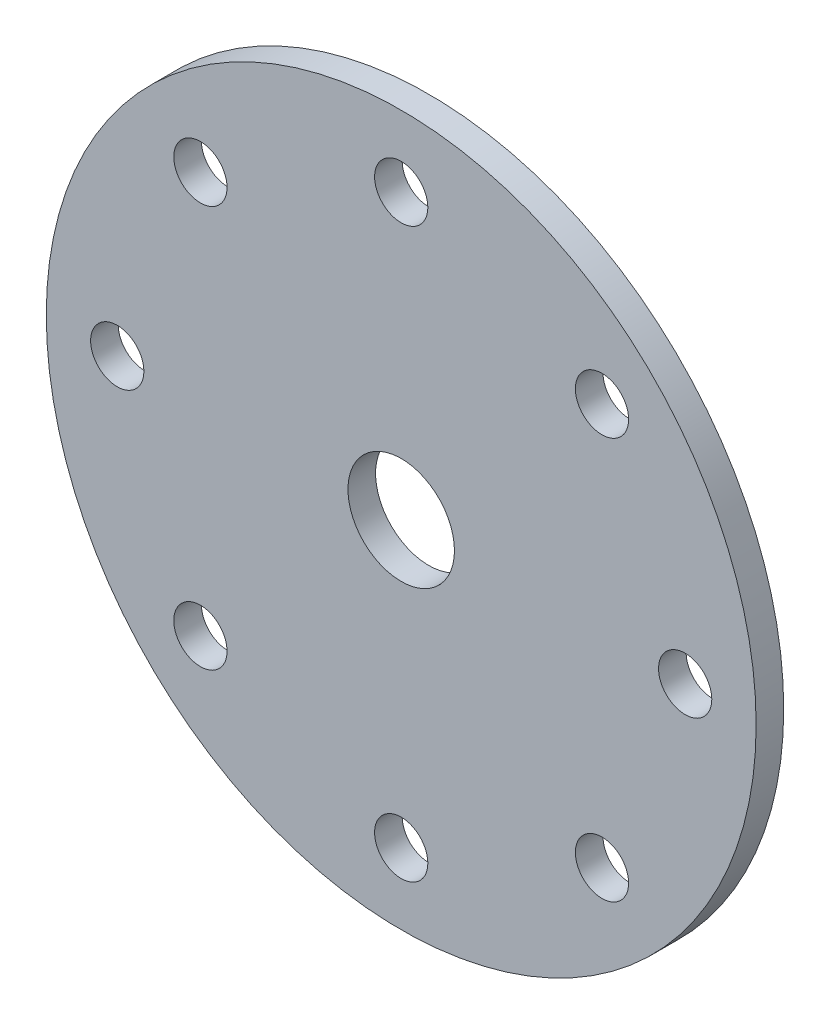
ISO-10303-21;
HEADER;
FILE_DESCRIPTION(('STEP AP214'),'2;1');
FILE_NAME('part.step','',(''),(''),'','','');
FILE_SCHEMA(('AUTOMOTIVE_DESIGN { 1 0 10303 214 1 1 1 1 }'));
ENDSEC;
DATA;
#1=APPLICATION_CONTEXT('core data for automotive mechanical design processes');
#2=APPLICATION_PROTOCOL_DEFINITION('international standard','automotive_design',2000,#1);
#3=PRODUCT_CONTEXT('',#1,'mechanical');
#4=PRODUCT('Part','Part','',(#3));
#5=PRODUCT_RELATED_PRODUCT_CATEGORY('part','',(#4));
#6=PRODUCT_DEFINITION_FORMATION('','',#4);
#7=PRODUCT_DEFINITION_CONTEXT('part definition',#1,'design');
#8=PRODUCT_DEFINITION('design','',#6,#7);
#9=PRODUCT_DEFINITION_SHAPE('','',#8);
#10=(LENGTH_UNIT() NAMED_UNIT(*) SI_UNIT(.MILLI.,.METRE.));
#11=(NAMED_UNIT(*) PLANE_ANGLE_UNIT() SI_UNIT($,.RADIAN.));
#12=(NAMED_UNIT(*) SI_UNIT($,.STERADIAN.) SOLID_ANGLE_UNIT());
#13=UNCERTAINTY_MEASURE_WITH_UNIT(LENGTH_MEASURE(1.E-05),#10,'distance_accuracy_value','');
#14=(GEOMETRIC_REPRESENTATION_CONTEXT(3) GLOBAL_UNCERTAINTY_ASSIGNED_CONTEXT((#13)) GLOBAL_UNIT_ASSIGNED_CONTEXT((#10,
#11,#12)) REPRESENTATION_CONTEXT('',''));
#15=CARTESIAN_POINT('',(0.,0.,0.));
#16=DIRECTION('',(0.,0.,1.));
#17=DIRECTION('',(1.,0.,0.));
#18=AXIS2_PLACEMENT_3D('',#15,#16,#17);
#19=CARTESIAN_POINT('',(0.,0.,4.93522));
#20=DIRECTION('',(0.,0.,-1.));
#21=DIRECTION('',(-1.,0.,0.));
#22=AXIS2_PLACEMENT_3D('',#19,#20,#21);
#23=CYLINDRICAL_SURFACE('',#22,9.525);
#24=CARTESIAN_POINT('',(0.,0.,4.93522));
#25=DIRECTION('',(0.,0.,1.));
#26=DIRECTION('',(1.,0.,0.));
#27=AXIS2_PLACEMENT_3D('',#24,#25,#26);
#28=CIRCLE('',#27,9.525);
#29=CARTESIAN_POINT('',(9.525,0.,4.93522));
#30=VERTEX_POINT('',#29);
#31=EDGE_CURVE('E42',#30,#30,#28,.T.);
#32=ORIENTED_EDGE('',*,*,#31,.T.);
#33=EDGE_LOOP('',(#32));
#34=FACE_BOUND('',#33,.T.);
#35=CARTESIAN_POINT('',(0.,0.,0.));
#36=DIRECTION('',(0.,0.,1.));
#37=DIRECTION('',(1.,0.,0.));
#38=AXIS2_PLACEMENT_3D('',#35,#36,#37);
#39=CIRCLE('',#38,9.525);
#40=CARTESIAN_POINT('',(9.525,0.,0.));
#41=VERTEX_POINT('',#40);
#42=EDGE_CURVE('E74',#41,#41,#39,.T.);
#43=ORIENTED_EDGE('',*,*,#42,.F.);
#44=EDGE_LOOP('',(#43));
#45=FACE_BOUND('',#44,.T.);
#46=ADVANCED_FACE('F34',(#34,#45),#23,.F.);
#47=CARTESIAN_POINT('',(0.,50.8,4.93522));
#48=DIRECTION('',(0.,0.,-1.));
#49=DIRECTION('',(-1.,0.,0.));
#50=AXIS2_PLACEMENT_3D('',#47,#48,#49);
#51=CYLINDRICAL_SURFACE('',#50,4.7625);
#52=CARTESIAN_POINT('',(0.,50.8,4.93522));
#53=DIRECTION('',(0.,0.,1.));
#54=DIRECTION('',(1.,0.,0.));
#55=AXIS2_PLACEMENT_3D('',#52,#53,#54);
#56=CIRCLE('',#55,4.7625);
#57=CARTESIAN_POINT('',(4.76250000000001,50.8,4.93522));
#58=VERTEX_POINT('',#57);
#59=EDGE_CURVE('E47',#58,#58,#56,.T.);
#60=ORIENTED_EDGE('',*,*,#59,.T.);
#61=EDGE_LOOP('',(#60));
#62=FACE_BOUND('',#61,.T.);
#63=CARTESIAN_POINT('',(0.,50.8,0.));
#64=DIRECTION('',(0.,0.,1.));
#65=DIRECTION('',(1.,0.,0.));
#66=AXIS2_PLACEMENT_3D('',#63,#64,#65);
#67=CIRCLE('',#66,4.7625);
#68=CARTESIAN_POINT('',(4.76250000000001,50.8,0.));
#69=VERTEX_POINT('',#68);
#70=EDGE_CURVE('E72',#69,#69,#67,.T.);
#71=ORIENTED_EDGE('',*,*,#70,.F.);
#72=EDGE_LOOP('',(#71));
#73=FACE_BOUND('',#72,.T.);
#74=ADVANCED_FACE('F107',(#62,#73),#51,.F.);
#75=CARTESIAN_POINT('',(35.9210244842766,35.9210244842766,4.93522));
#76=DIRECTION('',(0.,0.,-1.));
#77=DIRECTION('',(-1.,0.,0.));
#78=AXIS2_PLACEMENT_3D('',#75,#76,#77);
#79=CYLINDRICAL_SURFACE('',#78,4.7625);
#80=CARTESIAN_POINT('',(35.9210244842766,35.9210244842766,4.93522));
#81=DIRECTION('',(0.,0.,1.));
#82=DIRECTION('',(1.,0.,0.));
#83=AXIS2_PLACEMENT_3D('',#80,#81,#82);
#84=CIRCLE('',#83,4.7625);
#85=CARTESIAN_POINT('',(40.6835244842766,35.9210244842766,4.93522));
#86=VERTEX_POINT('',#85);
#87=EDGE_CURVE('E102',#86,#86,#84,.T.);
#88=ORIENTED_EDGE('',*,*,#87,.T.);
#89=EDGE_LOOP('',(#88));
#90=FACE_BOUND('',#89,.T.);
#91=CARTESIAN_POINT('',(35.9210244842766,35.9210244842766,0.));
#92=DIRECTION('',(0.,0.,1.));
#93=DIRECTION('',(1.,0.,0.));
#94=AXIS2_PLACEMENT_3D('',#91,#92,#93);
#95=CIRCLE('',#94,4.7625);
#96=CARTESIAN_POINT('',(40.6835244842766,35.9210244842766,0.));
#97=VERTEX_POINT('',#96);
#98=EDGE_CURVE('E69',#97,#97,#95,.T.);
#99=ORIENTED_EDGE('',*,*,#98,.F.);
#100=EDGE_LOOP('',(#99));
#101=FACE_BOUND('',#100,.T.);
#102=ADVANCED_FACE('F125',(#90,#101),#79,.F.);
#103=CARTESIAN_POINT('',(50.8,0.,4.93522));
#104=DIRECTION('',(0.,0.,-1.));
#105=DIRECTION('',(-1.,0.,0.));
#106=AXIS2_PLACEMENT_3D('',#103,#104,#105);
#107=CYLINDRICAL_SURFACE('',#106,4.76249999999999);
#108=CARTESIAN_POINT('',(50.8,0.,4.93522));
#109=DIRECTION('',(0.,0.,1.));
#110=DIRECTION('',(1.,0.,0.));
#111=AXIS2_PLACEMENT_3D('',#108,#109,#110);
#112=CIRCLE('',#111,4.76249999999999);
#113=CARTESIAN_POINT('',(55.5625,0.,4.93522));
#114=VERTEX_POINT('',#113);
#115=EDGE_CURVE('E99',#114,#114,#112,.T.);
#116=ORIENTED_EDGE('',*,*,#115,.T.);
#117=EDGE_LOOP('',(#116));
#118=FACE_BOUND('',#117,.T.);
#119=CARTESIAN_POINT('',(50.8,0.,0.));
#120=DIRECTION('',(0.,0.,1.));
#121=DIRECTION('',(1.,0.,0.));
#122=AXIS2_PLACEMENT_3D('',#119,#120,#121);
#123=CIRCLE('',#122,4.76249999999999);
#124=CARTESIAN_POINT('',(55.5625,0.,0.));
#125=VERTEX_POINT('',#124);
#126=EDGE_CURVE('E66',#125,#125,#123,.T.);
#127=ORIENTED_EDGE('',*,*,#126,.F.);
#128=EDGE_LOOP('',(#127));
#129=FACE_BOUND('',#128,.T.);
#130=ADVANCED_FACE('F132',(#118,#129),#107,.F.);
#131=CARTESIAN_POINT('',(35.9210244842766,-35.9210244842766,4.93522));
#132=DIRECTION('',(0.,0.,-1.));
#133=DIRECTION('',(-1.,0.,0.));
#134=AXIS2_PLACEMENT_3D('',#131,#132,#133);
#135=CYLINDRICAL_SURFACE('',#134,4.7625);
#136=CARTESIAN_POINT('',(35.9210244842766,-35.9210244842766,4.93522));
#137=DIRECTION('',(0.,0.,1.));
#138=DIRECTION('',(1.,0.,0.));
#139=AXIS2_PLACEMENT_3D('',#136,#137,#138);
#140=CIRCLE('',#139,4.7625);
#141=CARTESIAN_POINT('',(40.6835244842766,-35.9210244842766,4.93522));
#142=VERTEX_POINT('',#141);
#143=EDGE_CURVE('E96',#142,#142,#140,.T.);
#144=ORIENTED_EDGE('',*,*,#143,.T.);
#145=EDGE_LOOP('',(#144));
#146=FACE_BOUND('',#145,.T.);
#147=CARTESIAN_POINT('',(35.9210244842766,-35.9210244842766,0.));
#148=DIRECTION('',(0.,0.,1.));
#149=DIRECTION('',(1.,0.,0.));
#150=AXIS2_PLACEMENT_3D('',#147,#148,#149);
#151=CIRCLE('',#150,4.7625);
#152=CARTESIAN_POINT('',(40.6835244842766,-35.9210244842766,0.));
#153=VERTEX_POINT('',#152);
#154=EDGE_CURVE('E63',#153,#153,#151,.T.);
#155=ORIENTED_EDGE('',*,*,#154,.F.);
#156=EDGE_LOOP('',(#155));
#157=FACE_BOUND('',#156,.T.);
#158=ADVANCED_FACE('F136',(#146,#157),#135,.F.);
#159=CARTESIAN_POINT('',(0.,-50.8,4.93522));
#160=DIRECTION('',(0.,0.,-1.));
#161=DIRECTION('',(-1.,0.,0.));
#162=AXIS2_PLACEMENT_3D('',#159,#160,#161);
#163=CYLINDRICAL_SURFACE('',#162,4.7625);
#164=CARTESIAN_POINT('',(0.,-50.8,4.93522));
#165=DIRECTION('',(0.,0.,1.));
#166=DIRECTION('',(1.,0.,0.));
#167=AXIS2_PLACEMENT_3D('',#164,#165,#166);
#168=CIRCLE('',#167,4.7625);
#169=CARTESIAN_POINT('',(4.76250000000002,-50.8,4.93522));
#170=VERTEX_POINT('',#169);
#171=EDGE_CURVE('E93',#170,#170,#168,.T.);
#172=ORIENTED_EDGE('',*,*,#171,.T.);
#173=EDGE_LOOP('',(#172));
#174=FACE_BOUND('',#173,.T.);
#175=CARTESIAN_POINT('',(0.,-50.8,0.));
#176=DIRECTION('',(0.,0.,1.));
#177=DIRECTION('',(1.,0.,0.));
#178=AXIS2_PLACEMENT_3D('',#175,#176,#177);
#179=CIRCLE('',#178,4.7625);
#180=CARTESIAN_POINT('',(4.76250000000002,-50.8,0.));
#181=VERTEX_POINT('',#180);
#182=EDGE_CURVE('E60',#181,#181,#179,.T.);
#183=ORIENTED_EDGE('',*,*,#182,.F.);
#184=EDGE_LOOP('',(#183));
#185=FACE_BOUND('',#184,.T.);
#186=ADVANCED_FACE('F140',(#174,#185),#163,.F.);
#187=CARTESIAN_POINT('',(-35.9210244842766,-35.9210244842766,4.93522));
#188=DIRECTION('',(0.,0.,-1.));
#189=DIRECTION('',(-1.,0.,0.));
#190=AXIS2_PLACEMENT_3D('',#187,#188,#189);
#191=CYLINDRICAL_SURFACE('',#190,4.7625);
#192=CARTESIAN_POINT('',(-35.9210244842766,-35.9210244842766,4.93522));
#193=DIRECTION('',(0.,0.,1.));
#194=DIRECTION('',(1.,0.,0.));
#195=AXIS2_PLACEMENT_3D('',#192,#193,#194);
#196=CIRCLE('',#195,4.7625);
#197=CARTESIAN_POINT('',(-31.1585244842766,-35.9210244842766,4.93522));
#198=VERTEX_POINT('',#197);
#199=EDGE_CURVE('E88',#198,#198,#196,.T.);
#200=ORIENTED_EDGE('',*,*,#199,.T.);
#201=EDGE_LOOP('',(#200));
#202=FACE_BOUND('',#201,.T.);
#203=CARTESIAN_POINT('',(-35.9210244842766,-35.9210244842766,0.));
#204=DIRECTION('',(0.,0.,1.));
#205=DIRECTION('',(1.,0.,0.));
#206=AXIS2_PLACEMENT_3D('',#203,#204,#205);
#207=CIRCLE('',#206,4.7625);
#208=CARTESIAN_POINT('',(-31.1585244842766,-35.9210244842766,0.));
#209=VERTEX_POINT('',#208);
#210=EDGE_CURVE('E57',#209,#209,#207,.T.);
#211=ORIENTED_EDGE('',*,*,#210,.F.);
#212=EDGE_LOOP('',(#211));
#213=FACE_BOUND('',#212,.T.);
#214=ADVANCED_FACE('F144',(#202,#213),#191,.F.);
#215=CARTESIAN_POINT('',(-50.8,0.,4.93522));
#216=DIRECTION('',(0.,0.,-1.));
#217=DIRECTION('',(-1.,0.,0.));
#218=AXIS2_PLACEMENT_3D('',#215,#216,#217);
#219=CYLINDRICAL_SURFACE('',#218,4.7625);
#220=CARTESIAN_POINT('',(-50.8,0.,4.93522));
#221=DIRECTION('',(0.,0.,1.));
#222=DIRECTION('',(1.,0.,0.));
#223=AXIS2_PLACEMENT_3D('',#220,#221,#222);
#224=CIRCLE('',#223,4.7625);
#225=CARTESIAN_POINT('',(-46.0375,0.,4.93522));
#226=VERTEX_POINT('',#225);
#227=EDGE_CURVE('E83',#226,#226,#224,.T.);
#228=ORIENTED_EDGE('',*,*,#227,.T.);
#229=EDGE_LOOP('',(#228));
#230=FACE_BOUND('',#229,.T.);
#231=CARTESIAN_POINT('',(-50.8,0.,0.));
#232=DIRECTION('',(0.,0.,1.));
#233=DIRECTION('',(1.,0.,0.));
#234=AXIS2_PLACEMENT_3D('',#231,#232,#233);
#235=CIRCLE('',#234,4.7625);
#236=CARTESIAN_POINT('',(-46.0375,0.,0.));
#237=VERTEX_POINT('',#236);
#238=EDGE_CURVE('E54',#237,#237,#235,.T.);
#239=ORIENTED_EDGE('',*,*,#238,.F.);
#240=EDGE_LOOP('',(#239));
#241=FACE_BOUND('',#240,.T.);
#242=ADVANCED_FACE('F147',(#230,#241),#219,.F.);
#243=CARTESIAN_POINT('',(-35.9210244842766,35.9210244842766,4.93522));
#244=DIRECTION('',(0.,0.,-1.));
#245=DIRECTION('',(-1.,0.,0.));
#246=AXIS2_PLACEMENT_3D('',#243,#244,#245);
#247=CYLINDRICAL_SURFACE('',#246,4.7625);
#248=CARTESIAN_POINT('',(-35.9210244842766,35.9210244842766,4.93522));
#249=DIRECTION('',(0.,0.,1.));
#250=DIRECTION('',(1.,0.,0.));
#251=AXIS2_PLACEMENT_3D('',#248,#249,#250);
#252=CIRCLE('',#251,4.7625);
#253=CARTESIAN_POINT('',(-31.1585244842766,35.9210244842766,4.93522));
#254=VERTEX_POINT('',#253);
#255=EDGE_CURVE('E79',#254,#254,#252,.T.);
#256=ORIENTED_EDGE('',*,*,#255,.T.);
#257=EDGE_LOOP('',(#256));
#258=FACE_BOUND('',#257,.T.);
#259=CARTESIAN_POINT('',(-35.9210244842766,35.9210244842766,0.));
#260=DIRECTION('',(0.,0.,1.));
#261=DIRECTION('',(1.,0.,0.));
#262=AXIS2_PLACEMENT_3D('',#259,#260,#261);
#263=CIRCLE('',#262,4.7625);
#264=CARTESIAN_POINT('',(-31.1585244842766,35.9210244842766,0.));
#265=VERTEX_POINT('',#264);
#266=EDGE_CURVE('E51',#265,#265,#263,.T.);
#267=ORIENTED_EDGE('',*,*,#266,.F.);
#268=EDGE_LOOP('',(#267));
#269=FACE_BOUND('',#268,.T.);
#270=ADVANCED_FACE('F36',(#258,#269),#247,.F.);
#271=CARTESIAN_POINT('',(0.,0.,4.93522));
#272=DIRECTION('',(0.,0.,-1.));
#273=DIRECTION('',(-1.,0.,0.));
#274=AXIS2_PLACEMENT_3D('',#271,#272,#273);
#275=CYLINDRICAL_SURFACE('',#274,63.5);
#276=CARTESIAN_POINT('',(0.,0.,4.93522));
#277=DIRECTION('',(0.,0.,1.));
#278=DIRECTION('',(1.,0.,0.));
#279=AXIS2_PLACEMENT_3D('',#276,#277,#278);
#280=CIRCLE('',#279,63.5);
#281=CARTESIAN_POINT('',(63.5,0.,4.93522));
#282=VERTEX_POINT('',#281);
#283=EDGE_CURVE('E10',#282,#282,#280,.T.);
#284=ORIENTED_EDGE('',*,*,#283,.F.);
#285=EDGE_LOOP('',(#284));
#286=FACE_BOUND('',#285,.T.);
#287=CARTESIAN_POINT('',(0.,0.,0.));
#288=DIRECTION('',(0.,0.,1.));
#289=DIRECTION('',(1.,0.,0.));
#290=AXIS2_PLACEMENT_3D('',#287,#288,#289);
#291=CIRCLE('',#290,63.5);
#292=CARTESIAN_POINT('',(63.5,0.,0.));
#293=VERTEX_POINT('',#292);
#294=EDGE_CURVE('E38',#293,#293,#291,.T.);
#295=ORIENTED_EDGE('',*,*,#294,.T.);
#296=EDGE_LOOP('',(#295));
#297=FACE_BOUND('',#296,.T.);
#298=ADVANCED_FACE('F114',(#286,#297),#275,.T.);
#299=CARTESIAN_POINT('',(0.,0.,4.93522));
#300=DIRECTION('',(0.,0.,1.));
#301=DIRECTION('',(1.,0.,0.));
#302=AXIS2_PLACEMENT_3D('',#299,#300,#301);
#303=PLANE('',#302);
#304=ORIENTED_EDGE('',*,*,#255,.F.);
#305=EDGE_LOOP('',(#304));
#306=FACE_BOUND('',#305,.T.);
#307=ORIENTED_EDGE('',*,*,#227,.F.);
#308=EDGE_LOOP('',(#307));
#309=FACE_BOUND('',#308,.T.);
#310=ORIENTED_EDGE('',*,*,#199,.F.);
#311=EDGE_LOOP('',(#310));
#312=FACE_BOUND('',#311,.T.);
#313=ORIENTED_EDGE('',*,*,#171,.F.);
#314=EDGE_LOOP('',(#313));
#315=FACE_BOUND('',#314,.T.);
#316=ORIENTED_EDGE('',*,*,#143,.F.);
#317=EDGE_LOOP('',(#316));
#318=FACE_BOUND('',#317,.T.);
#319=ORIENTED_EDGE('',*,*,#115,.F.);
#320=EDGE_LOOP('',(#319));
#321=FACE_BOUND('',#320,.T.);
#322=ORIENTED_EDGE('',*,*,#87,.F.);
#323=EDGE_LOOP('',(#322));
#324=FACE_BOUND('',#323,.T.);
#325=ORIENTED_EDGE('',*,*,#59,.F.);
#326=EDGE_LOOP('',(#325));
#327=FACE_BOUND('',#326,.T.);
#328=ORIENTED_EDGE('',*,*,#31,.F.);
#329=EDGE_LOOP('',(#328));
#330=FACE_BOUND('',#329,.T.);
#331=ORIENTED_EDGE('',*,*,#283,.T.);
#332=EDGE_LOOP('',(#331));
#333=FACE_BOUND('',#332,.T.);
#334=ADVANCED_FACE('F110',(#306,#309,#312,#315,#318,#321,#324,#327,#330,#333),#303,.T.);
#335=CARTESIAN_POINT('',(0.,0.,0.));
#336=DIRECTION('',(0.,0.,1.));
#337=DIRECTION('',(1.,0.,0.));
#338=AXIS2_PLACEMENT_3D('',#335,#336,#337);
#339=PLANE('',#338);
#340=ORIENTED_EDGE('',*,*,#266,.T.);
#341=EDGE_LOOP('',(#340));
#342=FACE_BOUND('',#341,.T.);
#343=ORIENTED_EDGE('',*,*,#238,.T.);
#344=EDGE_LOOP('',(#343));
#345=FACE_BOUND('',#344,.T.);
#346=ORIENTED_EDGE('',*,*,#210,.T.);
#347=EDGE_LOOP('',(#346));
#348=FACE_BOUND('',#347,.T.);
#349=ORIENTED_EDGE('',*,*,#182,.T.);
#350=EDGE_LOOP('',(#349));
#351=FACE_BOUND('',#350,.T.);
#352=ORIENTED_EDGE('',*,*,#154,.T.);
#353=EDGE_LOOP('',(#352));
#354=FACE_BOUND('',#353,.T.);
#355=ORIENTED_EDGE('',*,*,#126,.T.);
#356=EDGE_LOOP('',(#355));
#357=FACE_BOUND('',#356,.T.);
#358=ORIENTED_EDGE('',*,*,#98,.T.);
#359=EDGE_LOOP('',(#358));
#360=FACE_BOUND('',#359,.T.);
#361=ORIENTED_EDGE('',*,*,#70,.T.);
#362=EDGE_LOOP('',(#361));
#363=FACE_BOUND('',#362,.T.);
#364=ORIENTED_EDGE('',*,*,#42,.T.);
#365=EDGE_LOOP('',(#364));
#366=FACE_BOUND('',#365,.T.);
#367=ORIENTED_EDGE('',*,*,#294,.F.);
#368=EDGE_LOOP('',(#367));
#369=FACE_BOUND('',#368,.T.);
#370=ADVANCED_FACE('F113',(#342,#345,#348,#351,#354,#357,#360,#363,#366,#369),#339,.F.);
#371=CLOSED_SHELL('',(#46,#74,#102,#130,#158,#186,#214,#242,#270,#298,#334,#370));
#372=MANIFOLD_SOLID_BREP('B2',#371);
#373=ADVANCED_BREP_SHAPE_REPRESENTATION('',(#18,#372),#14);
#374=SHAPE_DEFINITION_REPRESENTATION(#9,#373);
ENDSEC;
END-ISO-10303-21;
